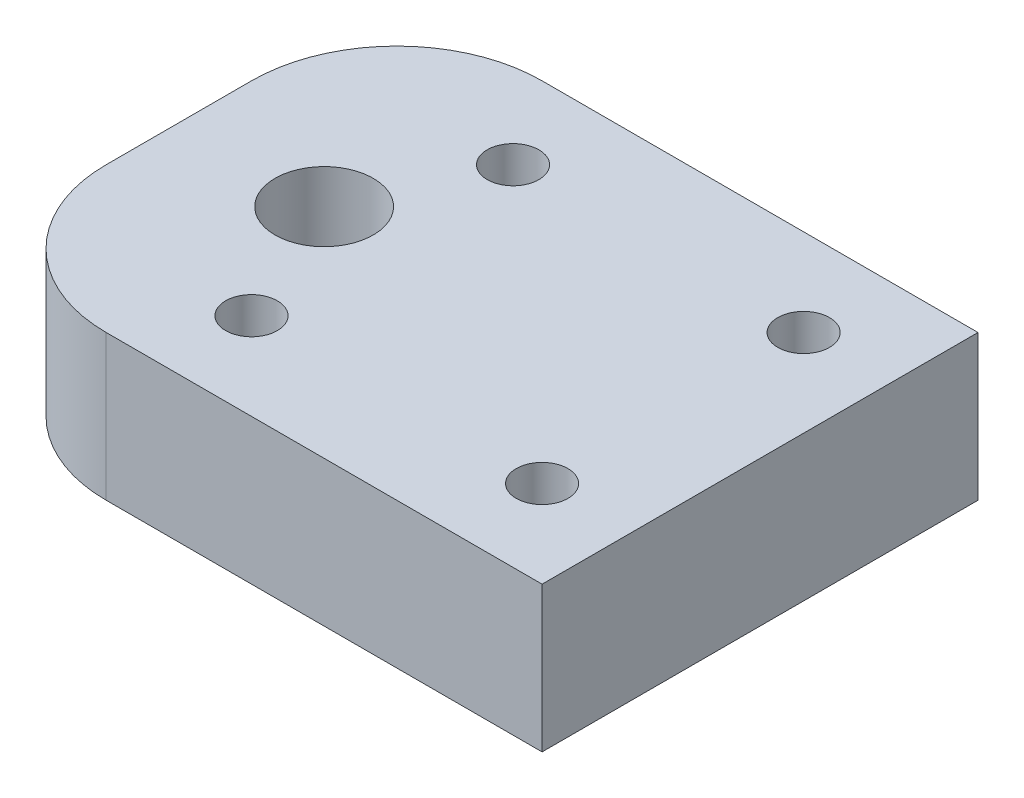
ISO-10303-21;
HEADER;
FILE_DESCRIPTION(('STEP AP214'),'2;1');
FILE_NAME('part.step','',(''),(''),'','','');
FILE_SCHEMA(('AUTOMOTIVE_DESIGN { 1 0 10303 214 1 1 1 1 }'));
ENDSEC;
DATA;
#1=APPLICATION_CONTEXT('core data for automotive mechanical design processes');
#2=APPLICATION_PROTOCOL_DEFINITION('international standard','automotive_design',2000,#1);
#3=PRODUCT_CONTEXT('',#1,'mechanical');
#4=PRODUCT('Part','Part','',(#3));
#5=PRODUCT_RELATED_PRODUCT_CATEGORY('part','',(#4));
#6=PRODUCT_DEFINITION_FORMATION('','',#4);
#7=PRODUCT_DEFINITION_CONTEXT('part definition',#1,'design');
#8=PRODUCT_DEFINITION('design','',#6,#7);
#9=PRODUCT_DEFINITION_SHAPE('','',#8);
#10=(LENGTH_UNIT() NAMED_UNIT(*) SI_UNIT(.MILLI.,.METRE.));
#11=(NAMED_UNIT(*) PLANE_ANGLE_UNIT() SI_UNIT($,.RADIAN.));
#12=(NAMED_UNIT(*) SI_UNIT($,.STERADIAN.) SOLID_ANGLE_UNIT());
#13=UNCERTAINTY_MEASURE_WITH_UNIT(LENGTH_MEASURE(1.E-05),#10,'distance_accuracy_value','');
#14=(GEOMETRIC_REPRESENTATION_CONTEXT(3) GLOBAL_UNCERTAINTY_ASSIGNED_CONTEXT((#13)) GLOBAL_UNIT_ASSIGNED_CONTEXT((#10,
#11,#12)) REPRESENTATION_CONTEXT('',''));
#15=CARTESIAN_POINT('',(0.,0.,0.));
#16=DIRECTION('',(0.,0.,1.));
#17=DIRECTION('',(1.,0.,0.));
#18=AXIS2_PLACEMENT_3D('',#15,#16,#17);
#19=CARTESIAN_POINT('',(0.,6.35,0.));
#20=DIRECTION('',(0.,1.,0.));
#21=DIRECTION('',(0.,0.,1.));
#22=AXIS2_PLACEMENT_3D('',#19,#20,#21);
#23=PLANE('',#22);
#24=CARTESIAN_POINT('',(2.54,6.35,-5.715));
#25=DIRECTION('',(0.,1.,0.));
#26=DIRECTION('',(0.,0.,1.));
#27=AXIS2_PLACEMENT_3D('',#24,#25,#26);
#28=CIRCLE('',#27,1.13029999999999);
#29=CARTESIAN_POINT('',(2.54,6.35,-4.58470000000001));
#30=VERTEX_POINT('',#29);
#31=EDGE_CURVE('E176',#30,#30,#28,.T.);
#32=ORIENTED_EDGE('',*,*,#31,.F.);
#33=EDGE_LOOP('',(#32));
#34=FACE_BOUND('',#33,.T.);
#35=CARTESIAN_POINT('',(15.24,6.35,5.715));
#36=DIRECTION('',(0.,1.,0.));
#37=DIRECTION('',(0.,0.,1.));
#38=AXIS2_PLACEMENT_3D('',#35,#36,#37);
#39=CIRCLE('',#38,1.13029999999999);
#40=CARTESIAN_POINT('',(15.24,6.35,6.84529999999999));
#41=VERTEX_POINT('',#40);
#42=EDGE_CURVE('E175',#41,#41,#39,.T.);
#43=ORIENTED_EDGE('',*,*,#42,.F.);
#44=EDGE_LOOP('',(#43));
#45=FACE_BOUND('',#44,.T.);
#46=CARTESIAN_POINT('',(2.54,6.35,5.715));
#47=DIRECTION('',(0.,1.,0.));
#48=DIRECTION('',(0.,0.,1.));
#49=AXIS2_PLACEMENT_3D('',#46,#47,#48);
#50=CIRCLE('',#49,1.13029999999999);
#51=CARTESIAN_POINT('',(2.54,6.35,6.84529999999999));
#52=VERTEX_POINT('',#51);
#53=EDGE_CURVE('E147',#52,#52,#50,.T.);
#54=ORIENTED_EDGE('',*,*,#53,.F.);
#55=EDGE_LOOP('',(#54));
#56=FACE_BOUND('',#55,.T.);
#57=CARTESIAN_POINT('',(15.24,6.35,-5.715));
#58=DIRECTION('',(0.,1.,0.));
#59=DIRECTION('',(0.,0.,1.));
#60=AXIS2_PLACEMENT_3D('',#57,#58,#59);
#61=CIRCLE('',#60,1.13029999999999);
#62=CARTESIAN_POINT('',(15.24,6.35,-4.58470000000001));
#63=VERTEX_POINT('',#62);
#64=EDGE_CURVE('E141',#63,#63,#61,.T.);
#65=ORIENTED_EDGE('',*,*,#64,.F.);
#66=EDGE_LOOP('',(#65));
#67=FACE_BOUND('',#66,.T.);
#68=DIRECTION('',(-1.,0.,0.));
#69=VECTOR('',#68,1.);
#70=CARTESIAN_POINT('',(-6.35,6.35,-9.525));
#71=LINE('',#70,#69);
#72=CARTESIAN_POINT('',(19.05,6.35,-9.525));
#73=VERTEX_POINT('',#72);
#74=CARTESIAN_POINT('',(0.,6.35,-9.525));
#75=VERTEX_POINT('',#74);
#76=EDGE_CURVE('E114',#73,#75,#71,.T.);
#77=ORIENTED_EDGE('',*,*,#76,.T.);
#78=CARTESIAN_POINT('',(0.,6.35,-3.175));
#79=DIRECTION('',(0.,1.,0.));
#80=DIRECTION('',(0.,0.,1.));
#81=AXIS2_PLACEMENT_3D('',#78,#79,#80);
#82=CIRCLE('',#81,6.35);
#83=CARTESIAN_POINT('',(-6.35,6.35,-3.175));
#84=VERTEX_POINT('',#83);
#85=EDGE_CURVE('E45',#75,#84,#82,.T.);
#86=ORIENTED_EDGE('',*,*,#85,.T.);
#87=DIRECTION('',(0.,0.,1.));
#88=VECTOR('',#87,1.);
#89=CARTESIAN_POINT('',(-6.35,6.35,-9.525));
#90=LINE('',#89,#88);
#91=CARTESIAN_POINT('',(-6.35,6.35,3.175));
#92=VERTEX_POINT('',#91);
#93=EDGE_CURVE('E99',#84,#92,#90,.T.);
#94=ORIENTED_EDGE('',*,*,#93,.T.);
#95=CARTESIAN_POINT('',(0.,6.35,3.175));
#96=DIRECTION('',(0.,1.,0.));
#97=DIRECTION('',(0.,0.,1.));
#98=AXIS2_PLACEMENT_3D('',#95,#96,#97);
#99=CIRCLE('',#98,6.35);
#100=CARTESIAN_POINT('',(0.,6.35,9.525));
#101=VERTEX_POINT('',#100);
#102=EDGE_CURVE('E52',#92,#101,#99,.T.);
#103=ORIENTED_EDGE('',*,*,#102,.T.);
#104=DIRECTION('',(1.,0.,0.));
#105=VECTOR('',#104,1.);
#106=CARTESIAN_POINT('',(-6.35,6.35,9.525));
#107=LINE('',#106,#105);
#108=CARTESIAN_POINT('',(19.05,6.35,9.525));
#109=VERTEX_POINT('',#108);
#110=EDGE_CURVE('E90',#101,#109,#107,.T.);
#111=ORIENTED_EDGE('',*,*,#110,.T.);
#112=DIRECTION('',(0.,0.,-1.));
#113=VECTOR('',#112,1.);
#114=CARTESIAN_POINT('',(19.05,6.35,-9.525));
#115=LINE('',#114,#113);
#116=EDGE_CURVE('E94',#109,#73,#115,.T.);
#117=ORIENTED_EDGE('',*,*,#116,.T.);
#118=EDGE_LOOP('',(#77,#86,#94,#103,#111,#117));
#119=FACE_BOUND('',#118,.T.);
#120=CARTESIAN_POINT('',(0.,6.35,0.));
#121=DIRECTION('',(0.,1.,0.));
#122=DIRECTION('',(0.,0.,1.));
#123=AXIS2_PLACEMENT_3D('',#120,#121,#122);
#124=CIRCLE('',#123,2.1463);
#125=CARTESIAN_POINT('',(0.,6.35,2.1463));
#126=VERTEX_POINT('',#125);
#127=EDGE_CURVE('E150',#126,#126,#124,.T.);
#128=ORIENTED_EDGE('',*,*,#127,.F.);
#129=EDGE_LOOP('',(#128));
#130=FACE_BOUND('',#129,.T.);
#131=ADVANCED_FACE('F37',(#34,#45,#56,#67,#119,#130),#23,.T.);
#132=CARTESIAN_POINT('',(0.,0.,0.));
#133=DIRECTION('',(0.,1.,0.));
#134=DIRECTION('',(0.,0.,1.));
#135=AXIS2_PLACEMENT_3D('',#132,#133,#134);
#136=PLANE('',#135);
#137=CARTESIAN_POINT('',(2.54,0.,-5.715));
#138=DIRECTION('',(0.,1.,0.));
#139=DIRECTION('',(0.,0.,1.));
#140=AXIS2_PLACEMENT_3D('',#137,#138,#139);
#141=CIRCLE('',#140,1.13029999999999);
#142=CARTESIAN_POINT('',(2.54,0.,-4.58470000000001));
#143=VERTEX_POINT('',#142);
#144=EDGE_CURVE('E172',#143,#143,#141,.T.);
#145=ORIENTED_EDGE('',*,*,#144,.T.);
#146=EDGE_LOOP('',(#145));
#147=FACE_BOUND('',#146,.T.);
#148=CARTESIAN_POINT('',(15.24,0.,5.715));
#149=DIRECTION('',(0.,1.,0.));
#150=DIRECTION('',(0.,0.,1.));
#151=AXIS2_PLACEMENT_3D('',#148,#149,#150);
#152=CIRCLE('',#151,1.13029999999999);
#153=CARTESIAN_POINT('',(15.24,0.,6.84529999999999));
#154=VERTEX_POINT('',#153);
#155=EDGE_CURVE('E243',#154,#154,#152,.T.);
#156=ORIENTED_EDGE('',*,*,#155,.T.);
#157=EDGE_LOOP('',(#156));
#158=FACE_BOUND('',#157,.T.);
#159=CARTESIAN_POINT('',(2.54,0.,5.715));
#160=DIRECTION('',(0.,1.,0.));
#161=DIRECTION('',(0.,0.,1.));
#162=AXIS2_PLACEMENT_3D('',#159,#160,#161);
#163=CIRCLE('',#162,1.13029999999999);
#164=CARTESIAN_POINT('',(2.54,0.,6.84529999999999));
#165=VERTEX_POINT('',#164);
#166=EDGE_CURVE('E146',#165,#165,#163,.T.);
#167=ORIENTED_EDGE('',*,*,#166,.T.);
#168=EDGE_LOOP('',(#167));
#169=FACE_BOUND('',#168,.T.);
#170=CARTESIAN_POINT('',(15.24,0.,-5.715));
#171=DIRECTION('',(0.,1.,0.));
#172=DIRECTION('',(0.,0.,1.));
#173=AXIS2_PLACEMENT_3D('',#170,#171,#172);
#174=CIRCLE('',#173,1.13029999999999);
#175=CARTESIAN_POINT('',(15.24,0.,-4.58470000000001));
#176=VERTEX_POINT('',#175);
#177=EDGE_CURVE('E145',#176,#176,#174,.T.);
#178=ORIENTED_EDGE('',*,*,#177,.T.);
#179=EDGE_LOOP('',(#178));
#180=FACE_BOUND('',#179,.T.);
#181=DIRECTION('',(0.,0.,1.));
#182=VECTOR('',#181,1.);
#183=CARTESIAN_POINT('',(-6.35,0.,-9.525));
#184=LINE('',#183,#182);
#185=CARTESIAN_POINT('',(-6.35,0.,-3.175));
#186=VERTEX_POINT('',#185);
#187=CARTESIAN_POINT('',(-6.35,0.,3.175));
#188=VERTEX_POINT('',#187);
#189=EDGE_CURVE('E154',#186,#188,#184,.T.);
#190=ORIENTED_EDGE('',*,*,#189,.F.);
#191=CARTESIAN_POINT('',(0.,0.,-3.175));
#192=DIRECTION('',(0.,1.,0.));
#193=DIRECTION('',(0.,0.,1.));
#194=AXIS2_PLACEMENT_3D('',#191,#192,#193);
#195=CIRCLE('',#194,6.35);
#196=CARTESIAN_POINT('',(0.,0.,-9.525));
#197=VERTEX_POINT('',#196);
#198=EDGE_CURVE('E182',#186,#197,#195,.F.);
#199=ORIENTED_EDGE('',*,*,#198,.T.);
#200=DIRECTION('',(-1.,0.,0.));
#201=VECTOR('',#200,1.);
#202=CARTESIAN_POINT('',(-6.35,0.,-9.525));
#203=LINE('',#202,#201);
#204=CARTESIAN_POINT('',(19.05,0.,-9.525));
#205=VERTEX_POINT('',#204);
#206=EDGE_CURVE('E159',#205,#197,#203,.T.);
#207=ORIENTED_EDGE('',*,*,#206,.F.);
#208=DIRECTION('',(0.,0.,-1.));
#209=VECTOR('',#208,1.);
#210=CARTESIAN_POINT('',(19.05,0.,-9.525));
#211=LINE('',#210,#209);
#212=CARTESIAN_POINT('',(19.05,0.,9.525));
#213=VERTEX_POINT('',#212);
#214=EDGE_CURVE('E161',#213,#205,#211,.T.);
#215=ORIENTED_EDGE('',*,*,#214,.F.);
#216=DIRECTION('',(1.,0.,0.));
#217=VECTOR('',#216,1.);
#218=CARTESIAN_POINT('',(-6.35,0.,9.525));
#219=LINE('',#218,#217);
#220=CARTESIAN_POINT('',(0.,0.,9.525));
#221=VERTEX_POINT('',#220);
#222=EDGE_CURVE('E105',#221,#213,#219,.T.);
#223=ORIENTED_EDGE('',*,*,#222,.F.);
#224=CARTESIAN_POINT('',(0.,0.,3.175));
#225=DIRECTION('',(0.,1.,0.));
#226=DIRECTION('',(0.,0.,1.));
#227=AXIS2_PLACEMENT_3D('',#224,#225,#226);
#228=CIRCLE('',#227,6.35);
#229=EDGE_CURVE('E181',#221,#188,#228,.F.);
#230=ORIENTED_EDGE('',*,*,#229,.T.);
#231=EDGE_LOOP('',(#190,#199,#207,#215,#223,#230));
#232=FACE_BOUND('',#231,.T.);
#233=CARTESIAN_POINT('',(0.,0.,0.));
#234=DIRECTION('',(0.,1.,0.));
#235=DIRECTION('',(0.,0.,1.));
#236=AXIS2_PLACEMENT_3D('',#233,#234,#235);
#237=CIRCLE('',#236,2.1463);
#238=CARTESIAN_POINT('',(0.,0.,2.1463));
#239=VERTEX_POINT('',#238);
#240=EDGE_CURVE('E155',#239,#239,#237,.T.);
#241=ORIENTED_EDGE('',*,*,#240,.T.);
#242=EDGE_LOOP('',(#241));
#243=FACE_BOUND('',#242,.T.);
#244=ADVANCED_FACE('F185',(#147,#158,#169,#180,#232,#243),#136,.F.);
#245=CARTESIAN_POINT('',(-6.35,6.35,-9.525));
#246=DIRECTION('',(1.,0.,0.));
#247=DIRECTION('',(0.,0.,-1.));
#248=AXIS2_PLACEMENT_3D('',#245,#246,#247);
#249=PLANE('',#248);
#250=ORIENTED_EDGE('',*,*,#93,.F.);
#251=DIRECTION('',(0.,-1.,0.));
#252=VECTOR('',#251,1.);
#253=CARTESIAN_POINT('',(-6.35,6.35,-3.175));
#254=LINE('',#253,#252);
#255=EDGE_CURVE('E178',#84,#186,#254,.T.);
#256=ORIENTED_EDGE('',*,*,#255,.T.);
#257=ORIENTED_EDGE('',*,*,#189,.T.);
#258=DIRECTION('',(0.,-1.,0.));
#259=VECTOR('',#258,1.);
#260=CARTESIAN_POINT('',(-6.35,6.35,3.175));
#261=LINE('',#260,#259);
#262=EDGE_CURVE('E108',#188,#92,#261,.F.);
#263=ORIENTED_EDGE('',*,*,#262,.T.);
#264=EDGE_LOOP('',(#250,#256,#257,#263));
#265=FACE_BOUND('',#264,.T.);
#266=ADVANCED_FACE('F193',(#265),#249,.F.);
#267=CARTESIAN_POINT('',(-6.35,6.35,9.525));
#268=DIRECTION('',(0.,0.,-1.));
#269=DIRECTION('',(-1.,0.,0.));
#270=AXIS2_PLACEMENT_3D('',#267,#268,#269);
#271=PLANE('',#270);
#272=ORIENTED_EDGE('',*,*,#110,.F.);
#273=DIRECTION('',(0.,-1.,0.));
#274=VECTOR('',#273,1.);
#275=CARTESIAN_POINT('',(0.,6.35,9.525));
#276=LINE('',#275,#274);
#277=EDGE_CURVE('E12',#101,#221,#276,.T.);
#278=ORIENTED_EDGE('',*,*,#277,.T.);
#279=ORIENTED_EDGE('',*,*,#222,.T.);
#280=DIRECTION('',(0.,-1.,0.));
#281=VECTOR('',#280,1.);
#282=CARTESIAN_POINT('',(19.05,6.35,9.525));
#283=LINE('',#282,#281);
#284=EDGE_CURVE('E102',#109,#213,#283,.T.);
#285=ORIENTED_EDGE('',*,*,#284,.F.);
#286=EDGE_LOOP('',(#272,#278,#279,#285));
#287=FACE_BOUND('',#286,.T.);
#288=ADVANCED_FACE('F103',(#287),#271,.F.);
#289=CARTESIAN_POINT('',(19.05,6.35,-9.525));
#290=DIRECTION('',(-1.,0.,0.));
#291=DIRECTION('',(0.,0.,1.));
#292=AXIS2_PLACEMENT_3D('',#289,#290,#291);
#293=PLANE('',#292);
#294=ORIENTED_EDGE('',*,*,#214,.T.);
#295=DIRECTION('',(0.,-1.,0.));
#296=VECTOR('',#295,1.);
#297=CARTESIAN_POINT('',(19.05,6.35,-9.525));
#298=LINE('',#297,#296);
#299=EDGE_CURVE('E109',#73,#205,#298,.T.);
#300=ORIENTED_EDGE('',*,*,#299,.F.);
#301=ORIENTED_EDGE('',*,*,#116,.F.);
#302=ORIENTED_EDGE('',*,*,#284,.T.);
#303=EDGE_LOOP('',(#294,#300,#301,#302));
#304=FACE_BOUND('',#303,.T.);
#305=ADVANCED_FACE('F111',(#304),#293,.F.);
#306=CARTESIAN_POINT('',(-6.35,6.35,-9.525));
#307=DIRECTION('',(0.,0.,1.));
#308=DIRECTION('',(1.,0.,0.));
#309=AXIS2_PLACEMENT_3D('',#306,#307,#308);
#310=PLANE('',#309);
#311=ORIENTED_EDGE('',*,*,#206,.T.);
#312=DIRECTION('',(0.,-1.,0.));
#313=VECTOR('',#312,1.);
#314=CARTESIAN_POINT('',(0.,6.35,-9.525));
#315=LINE('',#314,#313);
#316=EDGE_CURVE('E60',#197,#75,#315,.F.);
#317=ORIENTED_EDGE('',*,*,#316,.T.);
#318=ORIENTED_EDGE('',*,*,#76,.F.);
#319=ORIENTED_EDGE('',*,*,#299,.T.);
#320=EDGE_LOOP('',(#311,#317,#318,#319));
#321=FACE_BOUND('',#320,.T.);
#322=ADVANCED_FACE('F196',(#321),#310,.F.);
#323=CARTESIAN_POINT('',(0.,6.35,0.));
#324=DIRECTION('',(0.,-1.,0.));
#325=DIRECTION('',(0.,0.,-1.));
#326=AXIS2_PLACEMENT_3D('',#323,#324,#325);
#327=CYLINDRICAL_SURFACE('',#326,2.1463);
#328=ORIENTED_EDGE('',*,*,#127,.T.);
#329=EDGE_LOOP('',(#328));
#330=FACE_BOUND('',#329,.T.);
#331=ORIENTED_EDGE('',*,*,#240,.F.);
#332=EDGE_LOOP('',(#331));
#333=FACE_BOUND('',#332,.T.);
#334=ADVANCED_FACE('F198',(#330,#333),#327,.F.);
#335=CARTESIAN_POINT('',(15.24,6.35,-5.715));
#336=DIRECTION('',(0.,1.,0.));
#337=DIRECTION('',(0.,0.,1.));
#338=AXIS2_PLACEMENT_3D('',#335,#336,#337);
#339=CYLINDRICAL_SURFACE('',#338,1.13029999999999);
#340=ORIENTED_EDGE('',*,*,#64,.T.);
#341=EDGE_LOOP('',(#340));
#342=FACE_BOUND('',#341,.T.);
#343=ORIENTED_EDGE('',*,*,#177,.F.);
#344=EDGE_LOOP('',(#343));
#345=FACE_BOUND('',#344,.T.);
#346=ADVANCED_FACE('F204',(#342,#345),#339,.F.);
#347=CARTESIAN_POINT('',(2.54,6.35,5.715));
#348=DIRECTION('',(0.,1.,0.));
#349=DIRECTION('',(0.,0.,1.));
#350=AXIS2_PLACEMENT_3D('',#347,#348,#349);
#351=CYLINDRICAL_SURFACE('',#350,1.13029999999999);
#352=ORIENTED_EDGE('',*,*,#53,.T.);
#353=EDGE_LOOP('',(#352));
#354=FACE_BOUND('',#353,.T.);
#355=ORIENTED_EDGE('',*,*,#166,.F.);
#356=EDGE_LOOP('',(#355));
#357=FACE_BOUND('',#356,.T.);
#358=ADVANCED_FACE('F221',(#354,#357),#351,.F.);
#359=CARTESIAN_POINT('',(15.24,6.35,5.715));
#360=DIRECTION('',(0.,1.,0.));
#361=DIRECTION('',(0.,0.,1.));
#362=AXIS2_PLACEMENT_3D('',#359,#360,#361);
#363=CYLINDRICAL_SURFACE('',#362,1.13029999999999);
#364=ORIENTED_EDGE('',*,*,#42,.T.);
#365=EDGE_LOOP('',(#364));
#366=FACE_BOUND('',#365,.T.);
#367=ORIENTED_EDGE('',*,*,#155,.F.);
#368=EDGE_LOOP('',(#367));
#369=FACE_BOUND('',#368,.T.);
#370=ADVANCED_FACE('F225',(#366,#369),#363,.F.);
#371=CARTESIAN_POINT('',(2.54,6.35,-5.715));
#372=DIRECTION('',(0.,1.,0.));
#373=DIRECTION('',(0.,0.,1.));
#374=AXIS2_PLACEMENT_3D('',#371,#372,#373);
#375=CYLINDRICAL_SURFACE('',#374,1.13029999999999);
#376=ORIENTED_EDGE('',*,*,#31,.T.);
#377=EDGE_LOOP('',(#376));
#378=FACE_BOUND('',#377,.T.);
#379=ORIENTED_EDGE('',*,*,#144,.F.);
#380=EDGE_LOOP('',(#379));
#381=FACE_BOUND('',#380,.T.);
#382=ADVANCED_FACE('F229',(#378,#381),#375,.F.);
#383=CARTESIAN_POINT('',(0.,6.35,-3.175));
#384=DIRECTION('',(0.,-1.,0.));
#385=DIRECTION('',(0.,0.,-1.));
#386=AXIS2_PLACEMENT_3D('',#383,#384,#385);
#387=CYLINDRICAL_SURFACE('',#386,6.35);
#388=ORIENTED_EDGE('',*,*,#85,.F.);
#389=ORIENTED_EDGE('',*,*,#316,.F.);
#390=ORIENTED_EDGE('',*,*,#198,.F.);
#391=ORIENTED_EDGE('',*,*,#255,.F.);
#392=EDGE_LOOP('',(#388,#389,#390,#391));
#393=FACE_BOUND('',#392,.T.);
#394=ADVANCED_FACE('F191',(#393),#387,.T.);
#395=CARTESIAN_POINT('',(0.,6.35,3.175));
#396=DIRECTION('',(0.,-1.,0.));
#397=DIRECTION('',(0.,0.,-1.));
#398=AXIS2_PLACEMENT_3D('',#395,#396,#397);
#399=CYLINDRICAL_SURFACE('',#398,6.35);
#400=ORIENTED_EDGE('',*,*,#102,.F.);
#401=ORIENTED_EDGE('',*,*,#262,.F.);
#402=ORIENTED_EDGE('',*,*,#229,.F.);
#403=ORIENTED_EDGE('',*,*,#277,.F.);
#404=EDGE_LOOP('',(#400,#401,#402,#403));
#405=FACE_BOUND('',#404,.T.);
#406=ADVANCED_FACE('F39',(#405),#399,.T.);
#407=CLOSED_SHELL('',(#131,#244,#266,#288,#305,#322,#334,#346,#358,#370,#382,#394,#406));
#408=MANIFOLD_SOLID_BREP('B2',#407);
#409=ADVANCED_BREP_SHAPE_REPRESENTATION('',(#18,#408),#14);
#410=SHAPE_DEFINITION_REPRESENTATION(#9,#409);
ENDSEC;
END-ISO-10303-21;
